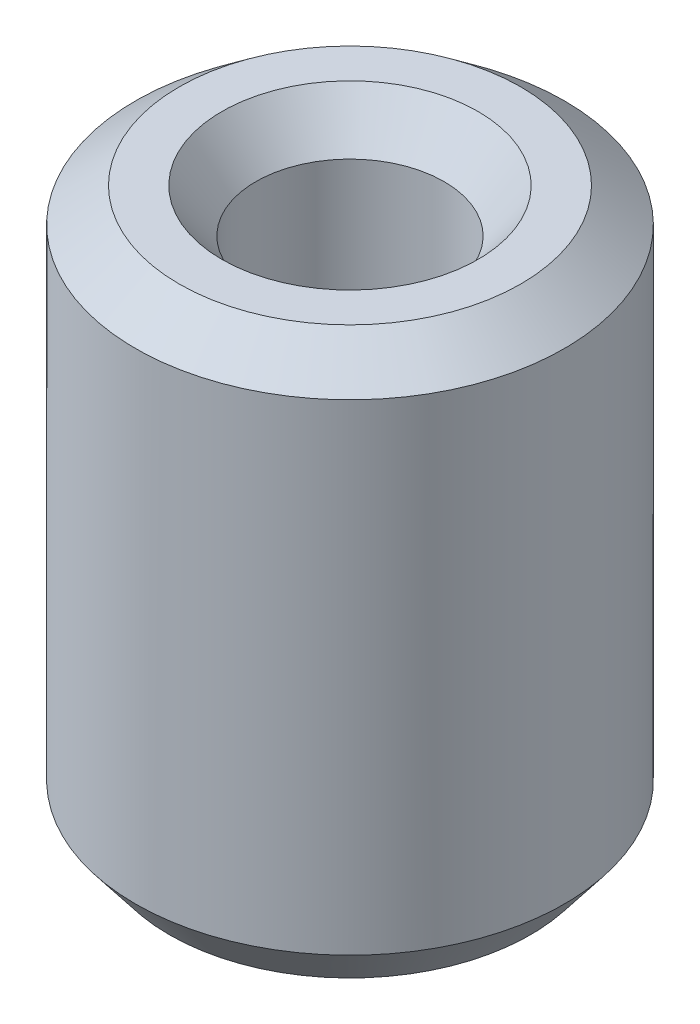
ISO-10303-21;
HEADER;
FILE_DESCRIPTION(('STEP AP214'),'2;1');
FILE_NAME('part.step','',(''),(''),'','','');
FILE_SCHEMA(('AUTOMOTIVE_DESIGN { 1 0 10303 214 1 1 1 1 }'));
ENDSEC;
DATA;
#1=APPLICATION_CONTEXT('core data for automotive mechanical design processes');
#2=APPLICATION_PROTOCOL_DEFINITION('international standard','automotive_design',2000,#1);
#3=PRODUCT_CONTEXT('',#1,'mechanical');
#4=PRODUCT('Part','Part','',(#3));
#5=PRODUCT_RELATED_PRODUCT_CATEGORY('part','',(#4));
#6=PRODUCT_DEFINITION_FORMATION('','',#4);
#7=PRODUCT_DEFINITION_CONTEXT('part definition',#1,'design');
#8=PRODUCT_DEFINITION('design','',#6,#7);
#9=PRODUCT_DEFINITION_SHAPE('','',#8);
#10=(LENGTH_UNIT() NAMED_UNIT(*) SI_UNIT(.MILLI.,.METRE.));
#11=(NAMED_UNIT(*) PLANE_ANGLE_UNIT() SI_UNIT($,.RADIAN.));
#12=(NAMED_UNIT(*) SI_UNIT($,.STERADIAN.) SOLID_ANGLE_UNIT());
#13=UNCERTAINTY_MEASURE_WITH_UNIT(LENGTH_MEASURE(1.E-05),#10,'distance_accuracy_value','');
#14=(GEOMETRIC_REPRESENTATION_CONTEXT(3) GLOBAL_UNCERTAINTY_ASSIGNED_CONTEXT((#13)) GLOBAL_UNIT_ASSIGNED_CONTEXT((#10,
#11,#12)) REPRESENTATION_CONTEXT('',''));
#15=CARTESIAN_POINT('',(0.,0.,0.));
#16=DIRECTION('',(0.,0.,1.));
#17=DIRECTION('',(1.,0.,0.));
#18=AXIS2_PLACEMENT_3D('',#15,#16,#17);
#19=CARTESIAN_POINT('',(0.,52.0929927510448,0.));
#20=DIRECTION('',(0.,-1.,0.));
#21=DIRECTION('',(0.,0.,-1.));
#22=AXIS2_PLACEMENT_3D('',#19,#20,#21);
#23=CYLINDRICAL_SURFACE('',#22,20.);
#24=CARTESIAN_POINT('',(0.,4.07730214121414,0.));
#25=DIRECTION('',(0.,1.,0.));
#26=DIRECTION('',(0.,0.,1.));
#27=AXIS2_PLACEMENT_3D('',#24,#25,#26);
#28=CIRCLE('',#27,20.);
#29=CARTESIAN_POINT('',(0.,4.07730214121414,-20.));
#30=VERTEX_POINT('',#29);
#31=EDGE_CURVE('E10',#30,#30,#28,.T.);
#32=CARTESIAN_POINT('',(0.,48.9260169286501,0.));
#33=DIRECTION('',(0.,1.,0.));
#34=DIRECTION('',(0.,0.,1.));
#35=AXIS2_PLACEMENT_3D('',#32,#33,#34);
#36=CIRCLE('',#35,20.);
#37=CARTESIAN_POINT('',(0.,48.9260169286501,-20.));
#38=VERTEX_POINT('',#37);
#39=EDGE_CURVE('E50',#38,#38,#36,.F.);
#40=CARTESIAN_POINT('',(0.,4.07730214121414,-20.));
#41=CARTESIAN_POINT('',(0.,4.54447625358326,-20.));
#42=CARTESIAN_POINT('',(0.,5.01165036595238,-20.));
#43=CARTESIAN_POINT('',(0.,5.94599859069063,-20.));
#44=CARTESIAN_POINT('',(0.,6.41317270305976,-20.));
#45=CARTESIAN_POINT('',(0.,7.34752092779801,-20.));
#46=CARTESIAN_POINT('',(0.,7.81469504016713,-20.));
#47=CARTESIAN_POINT('',(0.,8.74904326490538,-20.));
#48=CARTESIAN_POINT('',(0.,9.21621737727451,-20.));
#49=CARTESIAN_POINT('',(0.,10.1505656020128,-20.));
#50=CARTESIAN_POINT('',(0.,10.6177397143819,-20.));
#51=CARTESIAN_POINT('',(0.,11.5520879391201,-20.));
#52=CARTESIAN_POINT('',(0.,12.0192620514893,-20.));
#53=CARTESIAN_POINT('',(0.,12.9536102762275,-20.));
#54=CARTESIAN_POINT('',(0.,13.4207843885966,-20.));
#55=CARTESIAN_POINT('',(0.,14.3551326133349,-20.));
#56=CARTESIAN_POINT('',(0.,14.822306725704,-20.));
#57=CARTESIAN_POINT('',(0.,15.7566549504423,-20.));
#58=CARTESIAN_POINT('',(0.,16.2238290628114,-20.));
#59=CARTESIAN_POINT('',(0.,17.1581772875496,-20.));
#60=CARTESIAN_POINT('',(0.,17.6253513999188,-20.));
#61=CARTESIAN_POINT('',(0.,18.559699624657,-20.));
#62=CARTESIAN_POINT('',(0.,19.0268737370261,-20.));
#63=CARTESIAN_POINT('',(0.,19.9612219617644,-20.));
#64=CARTESIAN_POINT('',(0.,20.4283960741335,-20.));
#65=CARTESIAN_POINT('',(0.,21.3627442988717,-20.));
#66=CARTESIAN_POINT('',(0.,21.8299184112409,-20.));
#67=CARTESIAN_POINT('',(0.,22.7642666359791,-20.));
#68=CARTESIAN_POINT('',(0.,23.2314407483483,-20.));
#69=CARTESIAN_POINT('',(0.,24.1657889730865,-20.));
#70=CARTESIAN_POINT('',(0.,24.6329630854556,-20.));
#71=CARTESIAN_POINT('',(0.,25.5673113101939,-20.));
#72=CARTESIAN_POINT('',(0.,26.034485422563,-20.));
#73=CARTESIAN_POINT('',(0.,26.9688336473012,-20.));
#74=CARTESIAN_POINT('',(0.,27.4360077596704,-20.));
#75=CARTESIAN_POINT('',(0.,28.3703559844086,-20.));
#76=CARTESIAN_POINT('',(0.,28.8375300967777,-20.));
#77=CARTESIAN_POINT('',(0.,29.771878321516,-20.));
#78=CARTESIAN_POINT('',(0.,30.2390524338851,-20.));
#79=CARTESIAN_POINT('',(0.,31.1734006586234,-20.));
#80=CARTESIAN_POINT('',(0.,31.6405747709925,-20.));
#81=CARTESIAN_POINT('',(0.,32.5749229957307,-20.));
#82=CARTESIAN_POINT('',(0.,33.0420971080999,-20.));
#83=CARTESIAN_POINT('',(0.,33.9764453328381,-20.));
#84=CARTESIAN_POINT('',(0.,34.4436194452072,-20.));
#85=CARTESIAN_POINT('',(0.,35.3779676699455,-20.));
#86=CARTESIAN_POINT('',(0.,35.8451417823146,-20.));
#87=CARTESIAN_POINT('',(0.,36.7794900070529,-20.));
#88=CARTESIAN_POINT('',(0.,37.246664119422,-20.));
#89=CARTESIAN_POINT('',(0.,38.1810123441602,-20.));
#90=CARTESIAN_POINT('',(0.,38.6481864565294,-20.));
#91=CARTESIAN_POINT('',(0.,39.5825346812676,-20.));
#92=CARTESIAN_POINT('',(0.,40.0497087936367,-20.));
#93=CARTESIAN_POINT('',(0.,40.984057018375,-20.));
#94=CARTESIAN_POINT('',(0.,41.4512311307441,-20.));
#95=CARTESIAN_POINT('',(0.,42.3855793554824,-20.));
#96=CARTESIAN_POINT('',(0.,42.8527534678515,-20.));
#97=CARTESIAN_POINT('',(0.,43.7871016925897,-20.));
#98=CARTESIAN_POINT('',(0.,44.2542758049589,-20.));
#99=CARTESIAN_POINT('',(0.,45.1886240296971,-20.));
#100=CARTESIAN_POINT('',(0.,45.6557981420662,-20.));
#101=CARTESIAN_POINT('',(0.,46.5901463668045,-20.));
#102=CARTESIAN_POINT('',(0.,47.0573204791736,-20.));
#103=CARTESIAN_POINT('',(0.,47.9916687039119,-20.));
#104=CARTESIAN_POINT('',(0.,48.458842816281,-20.));
#105=CARTESIAN_POINT('',(0.,48.9260169286501,-20.));
#106=B_SPLINE_CURVE_WITH_KNOTS('',3,(#40,#41,#42,#43,#44,#45,#46,#47,#48,#49,#50,#51,#52,#53,
#54,#55,#56,#57,#58,#59,#60,#61,#62,#63,#64,#65,#66,#67,#68,#69,#70,#71,#72,#73,#74,#75,#76,#77,
#78,#79,#80,#81,#82,#83,#84,#85,#86,#87,#88,#89,#90,#91,#92,#93,#94,#95,#96,#97,#98,#99,#100,
#101,#102,#103,#104,#105),.UNSPECIFIED.,.F.,.F.,(4,2,2,2,2,2,2,2,2,2,2,2,2,2,2,2,2,2,2,2,2,2,2,
2,2,2,2,2,2,2,2,2,4),(0.,1.40152233710737,2.80304467421475,4.20456701132212,5.60608934842949,
7.00761168553687,8.40913402264425,9.81065635975162,11.212178696859,12.6137010339664,
14.0152233710737,15.4167457081811,16.8182680452885,18.2197903823959,19.6213127195032,
21.0228350566106,22.424357393718,23.8258797308254,25.2274020679327,26.6289244050401,
28.0304467421475,29.4319690792549,30.8334914163622,32.2350137534696,33.636536090577,
35.0380584276844,36.4395807647917,37.8411031018991,39.2426254390065,40.6441477761139,
42.0456701132212,43.4471924503286,44.848714787436),.UNSPECIFIED.);
#107=EDGE_CURVE('BSEAM39',#30,#38,#106,.T.);
#108=ORIENTED_EDGE('',*,*,#31,.T.);
#109=ORIENTED_EDGE('',*,*,#39,.T.);
#110=ORIENTED_EDGE('',*,*,#107,.T.);
#111=ORIENTED_EDGE('',*,*,#107,.F.);
#112=EDGE_LOOP('',(#108,#110,#109,#111));
#113=FACE_BOUND('',#112,.T.);
#114=ADVANCED_FACE('F39',(#113),#23,.T.);
#115=CARTESIAN_POINT('',(0.,52.0929927510448,0.));
#116=DIRECTION('',(0.,1.,0.));
#117=DIRECTION('',(0.,0.,1.));
#118=AXIS2_PLACEMENT_3D('',#115,#116,#117);
#119=PLANE('',#118);
#120=CARTESIAN_POINT('',(0.,52.0929927510448,0.));
#121=DIRECTION('',(0.,1.,0.));
#122=DIRECTION('',(0.,0.,1.));
#123=AXIS2_PLACEMENT_3D('',#120,#121,#122);
#124=CIRCLE('',#123,11.9466300449737);
#125=CARTESIAN_POINT('',(0.,52.0929927510448,11.9466300449737));
#126=VERTEX_POINT('',#125);
#127=EDGE_CURVE('E58',#126,#126,#124,.F.);
#128=ORIENTED_EDGE('',*,*,#127,.T.);
#129=EDGE_LOOP('',(#128));
#130=FACE_BOUND('',#129,.T.);
#131=CARTESIAN_POINT('',(0.,52.0929927510448,0.));
#132=DIRECTION('',(0.,1.,0.));
#133=DIRECTION('',(0.,0.,1.));
#134=AXIS2_PLACEMENT_3D('',#131,#132,#133);
#135=CIRCLE('',#134,15.9226978587859);
#136=CARTESIAN_POINT('',(0.,52.0929927510448,15.9226978587859));
#137=VERTEX_POINT('',#136);
#138=EDGE_CURVE('E61',#137,#137,#135,.T.);
#139=ORIENTED_EDGE('',*,*,#138,.T.);
#140=EDGE_LOOP('',(#139));
#141=FACE_BOUND('',#140,.T.);
#142=ADVANCED_FACE('F88',(#130,#141),#119,.T.);
#143=CARTESIAN_POINT('',(0.,0.,0.));
#144=DIRECTION('',(0.,1.,0.));
#145=DIRECTION('',(0.,0.,1.));
#146=AXIS2_PLACEMENT_3D('',#143,#144,#145);
#147=PLANE('',#146);
#148=CARTESIAN_POINT('',(0.,0.,0.));
#149=DIRECTION('',(0.,1.,0.));
#150=DIRECTION('',(0.,0.,1.));
#151=AXIS2_PLACEMENT_3D('',#148,#149,#150);
#152=CIRCLE('',#151,12.856956363793);
#153=CARTESIAN_POINT('',(0.,0.,12.856956363793));
#154=VERTEX_POINT('',#153);
#155=EDGE_CURVE('E51',#154,#154,#152,.T.);
#156=ORIENTED_EDGE('',*,*,#155,.T.);
#157=EDGE_LOOP('',(#156));
#158=FACE_BOUND('',#157,.T.);
#159=CARTESIAN_POINT('',(0.,0.,0.));
#160=DIRECTION('',(0.,1.,0.));
#161=DIRECTION('',(0.,0.,1.));
#162=AXIS2_PLACEMENT_3D('',#159,#160,#161);
#163=CIRCLE('',#162,16.8330241776052);
#164=CARTESIAN_POINT('',(0.,0.,16.8330241776052));
#165=VERTEX_POINT('',#164);
#166=EDGE_CURVE('E54',#165,#165,#163,.F.);
#167=ORIENTED_EDGE('',*,*,#166,.T.);
#168=EDGE_LOOP('',(#167));
#169=FACE_BOUND('',#168,.T.);
#170=ADVANCED_FACE('F83',(#158,#169),#147,.F.);
#171=CARTESIAN_POINT('',(0.,52.0929927510448,0.));
#172=DIRECTION('',(0.,-1.,0.));
#173=DIRECTION('',(0.,0.,-1.));
#174=AXIS2_PLACEMENT_3D('',#171,#172,#173);
#175=CYLINDRICAL_SURFACE('',#174,8.77965422257896);
#176=CARTESIAN_POINT('',(0.,48.0156906098307,0.));
#177=DIRECTION('',(0.,1.,0.));
#178=DIRECTION('',(0.,0.,1.));
#179=AXIS2_PLACEMENT_3D('',#176,#177,#178);
#180=CIRCLE('',#179,8.77965422257896);
#181=CARTESIAN_POINT('',(0.,48.0156906098307,-8.77965422257896));
#182=VERTEX_POINT('',#181);
#183=EDGE_CURVE('E67',#182,#182,#180,.T.);
#184=CARTESIAN_POINT('',(0.,3.16697582239474,0.));
#185=DIRECTION('',(0.,1.,0.));
#186=DIRECTION('',(0.,0.,1.));
#187=AXIS2_PLACEMENT_3D('',#184,#185,#186);
#188=CIRCLE('',#187,8.77965422257896);
#189=CARTESIAN_POINT('',(0.,3.16697582239473,-8.77965422257896));
#190=VERTEX_POINT('',#189);
#191=EDGE_CURVE('E69',#190,#190,#188,.F.);
#192=CARTESIAN_POINT('',(0.,48.0156906098307,-8.77965422257896));
#193=CARTESIAN_POINT('',(0.,47.5485164974616,-8.77965422257896));
#194=CARTESIAN_POINT('',(0.,47.0813423850925,-8.77965422257896));
#195=CARTESIAN_POINT('',(0.,46.1469941603542,-8.77965422257896));
#196=CARTESIAN_POINT('',(0.,45.6798200479851,-8.77965422257896));
#197=CARTESIAN_POINT('',(0.,44.7454718232468,-8.77965422257896));
#198=CARTESIAN_POINT('',(0.,44.2782977108777,-8.77965422257896));
#199=CARTESIAN_POINT('',(0.,43.3439494861395,-8.77965422257896));
#200=CARTESIAN_POINT('',(0.,42.8767753737704,-8.77965422257896));
#201=CARTESIAN_POINT('',(0.,41.9424271490321,-8.77965422257896));
#202=CARTESIAN_POINT('',(0.,41.475253036663,-8.77965422257896));
#203=CARTESIAN_POINT('',(0.,40.5409048119247,-8.77965422257896));
#204=CARTESIAN_POINT('',(0.,40.0737306995556,-8.77965422257896));
#205=CARTESIAN_POINT('',(0.,39.1393824748173,-8.77965422257896));
#206=CARTESIAN_POINT('',(0.,38.6722083624482,-8.77965422257896));
#207=CARTESIAN_POINT('',(0.,37.73786013771,-8.77965422257896));
#208=CARTESIAN_POINT('',(0.,37.2706860253408,-8.77965422257896));
#209=CARTESIAN_POINT('',(0.,36.3363378006026,-8.77965422257896));
#210=CARTESIAN_POINT('',(0.,35.8691636882335,-8.77965422257896));
#211=CARTESIAN_POINT('',(0.,34.9348154634952,-8.77965422257896));
#212=CARTESIAN_POINT('',(0.,34.4676413511261,-8.77965422257896));
#213=CARTESIAN_POINT('',(0.,33.5332931263879,-8.77965422257896));
#214=CARTESIAN_POINT('',(0.,33.0661190140187,-8.77965422257896));
#215=CARTESIAN_POINT('',(0.,32.1317707892805,-8.77965422257896));
#216=CARTESIAN_POINT('',(0.,31.6645966769114,-8.77965422257896));
#217=CARTESIAN_POINT('',(0.,30.7302484521731,-8.77965422257896));
#218=CARTESIAN_POINT('',(0.,30.263074339804,-8.77965422257896));
#219=CARTESIAN_POINT('',(0.,29.3287261150657,-8.77965422257896));
#220=CARTESIAN_POINT('',(0.,28.8615520026966,-8.77965422257896));
#221=CARTESIAN_POINT('',(0.,27.9272037779584,-8.77965422257896));
#222=CARTESIAN_POINT('',(0.,27.4600296655892,-8.77965422257896));
#223=CARTESIAN_POINT('',(0.,26.525681440851,-8.77965422257896));
#224=CARTESIAN_POINT('',(0.,26.0585073284819,-8.77965422257896));
#225=CARTESIAN_POINT('',(0.,25.1241591037436,-8.77965422257896));
#226=CARTESIAN_POINT('',(0.,24.6569849913745,-8.77965422257896));
#227=CARTESIAN_POINT('',(0.,23.7226367666362,-8.77965422257896));
#228=CARTESIAN_POINT('',(0.,23.2554626542671,-8.77965422257896));
#229=CARTESIAN_POINT('',(0.,22.3211144295289,-8.77965422257896));
#230=CARTESIAN_POINT('',(0.,21.8539403171597,-8.77965422257896));
#231=CARTESIAN_POINT('',(0.,20.9195920924215,-8.77965422257896));
#232=CARTESIAN_POINT('',(0.,20.4524179800524,-8.77965422257896));
#233=CARTESIAN_POINT('',(0.,19.5180697553141,-8.77965422257896));
#234=CARTESIAN_POINT('',(0.,19.050895642945,-8.77965422257896));
#235=CARTESIAN_POINT('',(0.,18.1165474182067,-8.77965422257896));
#236=CARTESIAN_POINT('',(0.,17.6493733058376,-8.77965422257896));
#237=CARTESIAN_POINT('',(0.,16.7150250810994,-8.77965422257896));
#238=CARTESIAN_POINT('',(0.,16.2478509687302,-8.77965422257896));
#239=CARTESIAN_POINT('',(0.,15.313502743992,-8.77965422257896));
#240=CARTESIAN_POINT('',(0.,14.8463286316229,-8.77965422257896));
#241=CARTESIAN_POINT('',(0.,13.9119804068846,-8.77965422257896));
#242=CARTESIAN_POINT('',(0.,13.4448062945155,-8.77965422257896));
#243=CARTESIAN_POINT('',(0.,12.5104580697772,-8.77965422257896));
#244=CARTESIAN_POINT('',(0.,12.0432839574081,-8.77965422257896));
#245=CARTESIAN_POINT('',(0.,11.1089357326699,-8.77965422257896));
#246=CARTESIAN_POINT('',(0.,10.6417616203007,-8.77965422257896));
#247=CARTESIAN_POINT('',(0.,9.70741339556248,-8.77965422257896));
#248=CARTESIAN_POINT('',(0.,9.24023928319336,-8.77965422257896));
#249=CARTESIAN_POINT('',(0.,8.30589105845511,-8.77965422257896));
#250=CARTESIAN_POINT('',(0.,7.83871694608598,-8.77965422257896));
#251=CARTESIAN_POINT('',(0.,6.90436872134774,-8.77965422257896));
#252=CARTESIAN_POINT('',(0.,6.43719460897861,-8.77965422257896));
#253=CARTESIAN_POINT('',(0.,5.50284638424036,-8.77965422257896));
#254=CARTESIAN_POINT('',(0.,5.03567227187123,-8.77965422257896));
#255=CARTESIAN_POINT('',(0.,4.10132404713298,-8.77965422257896));
#256=CARTESIAN_POINT('',(0.,3.63414993476386,-8.77965422257896));
#257=CARTESIAN_POINT('',(0.,3.16697582239473,-8.77965422257896));
#258=B_SPLINE_CURVE_WITH_KNOTS('',3,(#192,#193,#194,#195,#196,#197,#198,#199,#200,#201,#202,
#203,#204,#205,#206,#207,#208,#209,#210,#211,#212,#213,#214,#215,#216,#217,#218,#219,#220,#221,
#222,#223,#224,#225,#226,#227,#228,#229,#230,#231,#232,#233,#234,#235,#236,#237,#238,#239,#240,
#241,#242,#243,#244,#245,#246,#247,#248,#249,#250,#251,#252,#253,#254,#255,#256,#257),
.UNSPECIFIED.,.F.,.F.,(4,2,2,2,2,2,2,2,2,2,2,2,2,2,2,2,2,2,2,2,2,2,2,2,2,2,2,2,2,2,2,2,4),(0.,
1.40152233710738,2.80304467421475,4.20456701132212,5.6060893484295,7.00761168553687,
8.40913402264425,9.81065635975163,11.212178696859,12.6137010339664,14.0152233710737,
15.4167457081811,16.8182680452885,18.2197903823959,19.6213127195032,21.0228350566106,
22.424357393718,23.8258797308254,25.2274020679327,26.6289244050401,28.0304467421475,
29.4319690792549,30.8334914163622,32.2350137534696,33.636536090577,35.0380584276844,
36.4395807647917,37.8411031018991,39.2426254390065,40.6441477761139,42.0456701132212,
43.4471924503286,44.848714787436),.UNSPECIFIED.);
#259=EDGE_CURVE('BSEAM71',#182,#190,#258,.T.);
#260=ORIENTED_EDGE('',*,*,#183,.T.);
#261=ORIENTED_EDGE('',*,*,#191,.T.);
#262=ORIENTED_EDGE('',*,*,#259,.T.);
#263=ORIENTED_EDGE('',*,*,#259,.F.);
#264=EDGE_LOOP('',(#260,#262,#261,#263));
#265=FACE_BOUND('',#264,.T.);
#266=ADVANCED_FACE('F71',(#265),#175,.F.);
#267=CARTESIAN_POINT('',(0.,48.0156906098307,0.));
#268=DIRECTION('',(0.,1.,0.));
#269=DIRECTION('',(0.,0.,1.));
#270=AXIS2_PLACEMENT_3D('',#267,#268,#269);
#271=CONICAL_SURFACE('',#270,8.77965422257896,0.660391969079187);
#272=ORIENTED_EDGE('',*,*,#127,.F.);
#273=EDGE_LOOP('',(#272));
#274=FACE_BOUND('',#273,.T.);
#275=ORIENTED_EDGE('',*,*,#183,.F.);
#276=EDGE_LOOP('',(#275));
#277=FACE_BOUND('',#276,.T.);
#278=ADVANCED_FACE('F77',(#274,#277),#271,.F.);
#279=CARTESIAN_POINT('',(0.,0.,0.));
#280=DIRECTION('',(0.,-1.,0.));
#281=DIRECTION('',(0.,0.,-1.));
#282=AXIS2_PLACEMENT_3D('',#279,#280,#281);
#283=CONICAL_SURFACE('',#282,12.856956363793,0.910404357715709);
#284=ORIENTED_EDGE('',*,*,#191,.F.);
#285=EDGE_LOOP('',(#284));
#286=FACE_BOUND('',#285,.T.);
#287=ORIENTED_EDGE('',*,*,#155,.F.);
#288=EDGE_LOOP('',(#287));
#289=FACE_BOUND('',#288,.T.);
#290=ADVANCED_FACE('F73',(#286,#289),#283,.F.);
#291=CARTESIAN_POINT('',(0.,4.07730214121414,0.));
#292=DIRECTION('',(0.,1.,0.));
#293=DIRECTION('',(0.,0.,1.));
#294=AXIS2_PLACEMENT_3D('',#291,#292,#293);
#295=CONICAL_SURFACE('',#294,20.,0.660391969079186);
#296=ORIENTED_EDGE('',*,*,#166,.F.);
#297=EDGE_LOOP('',(#296));
#298=FACE_BOUND('',#297,.T.);
#299=ORIENTED_EDGE('',*,*,#31,.F.);
#300=EDGE_LOOP('',(#299));
#301=FACE_BOUND('',#300,.T.);
#302=ADVANCED_FACE('F76',(#298,#301),#295,.T.);
#303=CARTESIAN_POINT('',(0.,52.0929927510448,0.));
#304=DIRECTION('',(0.,-1.,0.));
#305=DIRECTION('',(0.,0.,-1.));
#306=AXIS2_PLACEMENT_3D('',#303,#304,#305);
#307=CONICAL_SURFACE('',#306,15.9226978587859,0.910404357715711);
#308=ORIENTED_EDGE('',*,*,#39,.F.);
#309=EDGE_LOOP('',(#308));
#310=FACE_BOUND('',#309,.T.);
#311=ORIENTED_EDGE('',*,*,#138,.F.);
#312=EDGE_LOOP('',(#311));
#313=FACE_BOUND('',#312,.T.);
#314=ADVANCED_FACE('F45',(#310,#313),#307,.T.);
#315=CLOSED_SHELL('',(#114,#142,#170,#266,#278,#290,#302,#314));
#316=MANIFOLD_SOLID_BREP('B2',#315);
#317=ADVANCED_BREP_SHAPE_REPRESENTATION('',(#18,#316),#14);
#318=SHAPE_DEFINITION_REPRESENTATION(#9,#317);
ENDSEC;
END-ISO-10303-21;
